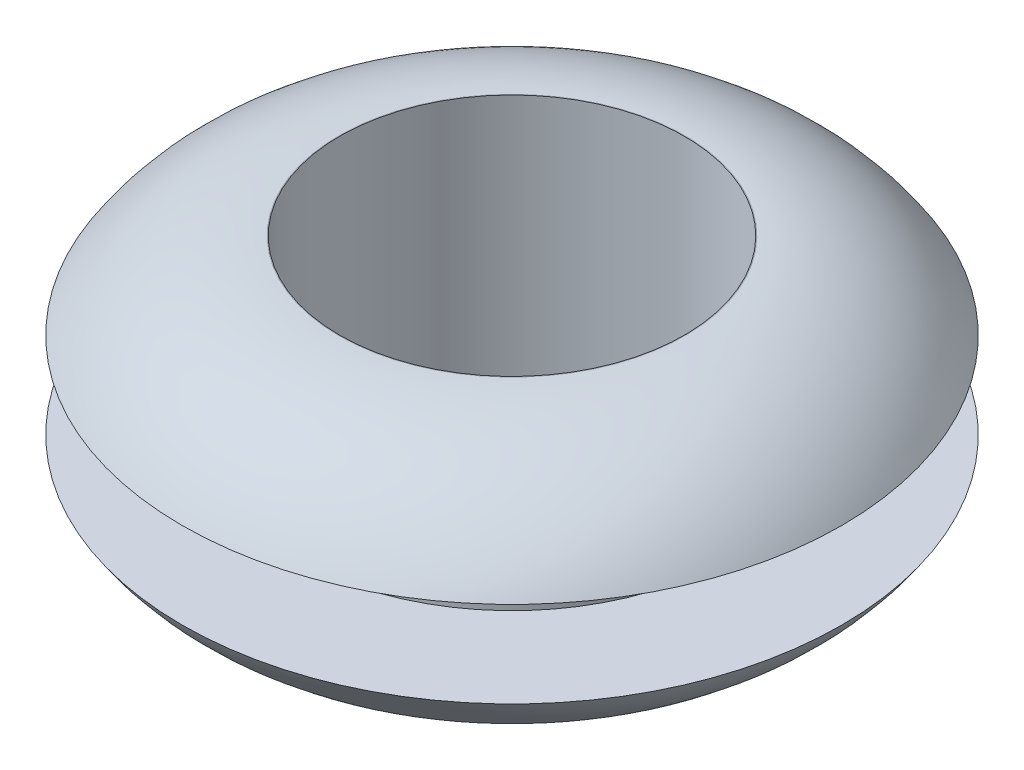
ISO-10303-21;
HEADER;
FILE_DESCRIPTION(('STEP AP214'),'2;1');
FILE_NAME('part.step','',(''),(''),'','','');
FILE_SCHEMA(('AUTOMOTIVE_DESIGN { 1 0 10303 214 1 1 1 1 }'));
ENDSEC;
DATA;
#1=APPLICATION_CONTEXT('core data for automotive mechanical design processes');
#2=APPLICATION_PROTOCOL_DEFINITION('international standard','automotive_design',2000,#1);
#3=PRODUCT_CONTEXT('',#1,'mechanical');
#4=PRODUCT('Part','Part','',(#3));
#5=PRODUCT_RELATED_PRODUCT_CATEGORY('part','',(#4));
#6=PRODUCT_DEFINITION_FORMATION('','',#4);
#7=PRODUCT_DEFINITION_CONTEXT('part definition',#1,'design');
#8=PRODUCT_DEFINITION('design','',#6,#7);
#9=PRODUCT_DEFINITION_SHAPE('','',#8);
#10=(LENGTH_UNIT() NAMED_UNIT(*) SI_UNIT(.MILLI.,.METRE.));
#11=(NAMED_UNIT(*) PLANE_ANGLE_UNIT() SI_UNIT($,.RADIAN.));
#12=(NAMED_UNIT(*) SI_UNIT($,.STERADIAN.) SOLID_ANGLE_UNIT());
#13=UNCERTAINTY_MEASURE_WITH_UNIT(LENGTH_MEASURE(1.E-05),#10,'distance_accuracy_value','');
#14=(GEOMETRIC_REPRESENTATION_CONTEXT(3) GLOBAL_UNCERTAINTY_ASSIGNED_CONTEXT((#13)) GLOBAL_UNIT_ASSIGNED_CONTEXT((#10,
#11,#12)) REPRESENTATION_CONTEXT('',''));
#15=CARTESIAN_POINT('',(0.,0.,0.));
#16=DIRECTION('',(0.,0.,1.));
#17=DIRECTION('',(1.,0.,0.));
#18=AXIS2_PLACEMENT_3D('',#15,#16,#17);
#19=CARTESIAN_POINT('',(0.,6.,0.));
#20=DIRECTION('',(0.,1.,0.));
#21=DIRECTION('',(0.,0.,1.));
#22=AXIS2_PLACEMENT_3D('',#19,#20,#21);
#23=PLANE('',#22);
#24=CARTESIAN_POINT('',(0.,6.,0.));
#25=DIRECTION('',(0.,1.,0.));
#26=DIRECTION('',(0.,0.,1.));
#27=AXIS2_PLACEMENT_3D('',#24,#25,#26);
#28=CIRCLE('',#27,4.01681957508301);
#29=CARTESIAN_POINT('',(0.,6.,4.01681957508301));
#30=VERTEX_POINT('',#29);
#31=EDGE_CURVE('E10',#30,#30,#28,.T.);
#32=ORIENTED_EDGE('',*,*,#31,.T.);
#33=EDGE_LOOP('',(#32));
#34=FACE_BOUND('',#33,.T.);
#35=CARTESIAN_POINT('',(0.,6.,0.));
#36=DIRECTION('',(0.,1.,0.));
#37=DIRECTION('',(0.,0.,1.));
#38=AXIS2_PLACEMENT_3D('',#35,#36,#37);
#39=CIRCLE('',#38,4.);
#40=CARTESIAN_POINT('',(0.,6.,4.));
#41=VERTEX_POINT('',#40);
#42=EDGE_CURVE('E41',#41,#41,#39,.T.);
#43=ORIENTED_EDGE('',*,*,#42,.F.);
#44=EDGE_LOOP('',(#43));
#45=FACE_BOUND('',#44,.T.);
#46=ADVANCED_FACE('F30',(#34,#45),#23,.T.);
#47=CARTESIAN_POINT('',(0.,0.,0.));
#48=DIRECTION('',(0.,1.,0.));
#49=DIRECTION('',(0.,0.,1.));
#50=AXIS2_PLACEMENT_3D('',#47,#48,#49);
#51=PLANE('',#50);
#52=CARTESIAN_POINT('',(0.,0.,0.));
#53=DIRECTION('',(0.,1.,0.));
#54=DIRECTION('',(0.,0.,1.));
#55=AXIS2_PLACEMENT_3D('',#52,#53,#54);
#56=CIRCLE('',#55,4.01681957508301);
#57=CARTESIAN_POINT('',(0.,0.,4.01681957508301));
#58=VERTEX_POINT('',#57);
#59=EDGE_CURVE('E37',#58,#58,#56,.F.);
#60=ORIENTED_EDGE('',*,*,#59,.T.);
#61=EDGE_LOOP('',(#60));
#62=FACE_BOUND('',#61,.T.);
#63=CARTESIAN_POINT('',(0.,0.,0.));
#64=DIRECTION('',(0.,1.,0.));
#65=DIRECTION('',(0.,0.,1.));
#66=AXIS2_PLACEMENT_3D('',#63,#64,#65);
#67=CIRCLE('',#66,4.);
#68=CARTESIAN_POINT('',(0.,0.,4.));
#69=VERTEX_POINT('',#68);
#70=EDGE_CURVE('E45',#69,#69,#67,.T.);
#71=ORIENTED_EDGE('',*,*,#70,.T.);
#72=EDGE_LOOP('',(#71));
#73=FACE_BOUND('',#72,.T.);
#74=ADVANCED_FACE('F85',(#62,#73),#51,.F.);
#75=CARTESIAN_POINT('',(0.,6.,0.));
#76=DIRECTION('',(0.,-1.,0.));
#77=DIRECTION('',(0.,0.,-1.));
#78=AXIS2_PLACEMENT_3D('',#75,#76,#77);
#79=CYLINDRICAL_SURFACE('',#78,4.);
#80=ORIENTED_EDGE('',*,*,#42,.T.);
#81=EDGE_LOOP('',(#80));
#82=FACE_BOUND('',#81,.T.);
#83=ORIENTED_EDGE('',*,*,#70,.F.);
#84=EDGE_LOOP('',(#83));
#85=FACE_BOUND('',#84,.T.);
#86=ADVANCED_FACE('F70',(#82,#85),#79,.F.);
#87=CARTESIAN_POINT('',(0.,2.,0.));
#88=DIRECTION('',(0.,1.,0.));
#89=DIRECTION('',(0.,0.,1.));
#90=AXIS2_PLACEMENT_3D('',#87,#88,#89);
#91=PLANE('',#90);
#92=CARTESIAN_POINT('',(0.,2.,0.));
#93=DIRECTION('',(0.,1.,0.));
#94=DIRECTION('',(0.,0.,1.));
#95=AXIS2_PLACEMENT_3D('',#92,#93,#94);
#96=CIRCLE('',#95,5.);
#97=CARTESIAN_POINT('',(0.,2.,5.));
#98=VERTEX_POINT('',#97);
#99=EDGE_CURVE('E54',#98,#98,#96,.T.);
#100=ORIENTED_EDGE('',*,*,#99,.F.);
#101=EDGE_LOOP('',(#100));
#102=FACE_BOUND('',#101,.T.);
#103=CARTESIAN_POINT('',(0.,2.,0.));
#104=DIRECTION('',(0.,1.,0.));
#105=DIRECTION('',(0.,0.,1.));
#106=AXIS2_PLACEMENT_3D('',#103,#104,#105);
#107=CIRCLE('',#106,7.65);
#108=CARTESIAN_POINT('',(0.,2.,7.65));
#109=VERTEX_POINT('',#108);
#110=EDGE_CURVE('E49',#109,#109,#107,.T.);
#111=ORIENTED_EDGE('',*,*,#110,.T.);
#112=EDGE_LOOP('',(#111));
#113=FACE_BOUND('',#112,.T.);
#114=ADVANCED_FACE('F66',(#102,#113),#91,.T.);
#115=CARTESIAN_POINT('',(0.,4.,0.));
#116=DIRECTION('',(0.,1.,0.));
#117=DIRECTION('',(0.,0.,1.));
#118=AXIS2_PLACEMENT_3D('',#115,#116,#117);
#119=PLANE('',#118);
#120=CARTESIAN_POINT('',(0.,4.,0.));
#121=DIRECTION('',(0.,1.,0.));
#122=DIRECTION('',(0.,0.,1.));
#123=AXIS2_PLACEMENT_3D('',#120,#121,#122);
#124=CIRCLE('',#123,5.);
#125=CARTESIAN_POINT('',(0.,4.,5.));
#126=VERTEX_POINT('',#125);
#127=EDGE_CURVE('E57',#126,#126,#124,.T.);
#128=ORIENTED_EDGE('',*,*,#127,.T.);
#129=EDGE_LOOP('',(#128));
#130=FACE_BOUND('',#129,.T.);
#131=CARTESIAN_POINT('',(0.,4.,0.));
#132=DIRECTION('',(0.,1.,0.));
#133=DIRECTION('',(0.,0.,1.));
#134=AXIS2_PLACEMENT_3D('',#131,#132,#133);
#135=CIRCLE('',#134,7.65);
#136=CARTESIAN_POINT('',(0.,4.,7.65));
#137=VERTEX_POINT('',#136);
#138=EDGE_CURVE('E51',#137,#137,#135,.T.);
#139=ORIENTED_EDGE('',*,*,#138,.F.);
#140=EDGE_LOOP('',(#139));
#141=FACE_BOUND('',#140,.T.);
#142=ADVANCED_FACE('F69',(#130,#141),#119,.F.);
#143=CARTESIAN_POINT('',(0.,2.,0.));
#144=DIRECTION('',(0.,1.,0.));
#145=DIRECTION('',(0.,0.,1.));
#146=AXIS2_PLACEMENT_3D('',#143,#144,#145);
#147=CYLINDRICAL_SURFACE('',#146,5.);
#148=ORIENTED_EDGE('',*,*,#99,.T.);
#149=EDGE_LOOP('',(#148));
#150=FACE_BOUND('',#149,.T.);
#151=ORIENTED_EDGE('',*,*,#127,.F.);
#152=EDGE_LOOP('',(#151));
#153=FACE_BOUND('',#152,.T.);
#154=ADVANCED_FACE('F63',(#150,#153),#147,.T.);
#155=CARTESIAN_POINT('',(0.,4.3,0.));
#156=DIRECTION('',(0.,-1.,0.));
#157=DIRECTION('',(0.,0.,-1.));
#158=AXIS2_PLACEMENT_3D('',#155,#156,#157);
#159=DEGENERATE_TOROIDAL_SURFACE('',#158,4.01681957508301,4.3,.T.);
#160=ORIENTED_EDGE('',*,*,#59,.F.);
#161=EDGE_LOOP('',(#160));
#162=FACE_BOUND('',#161,.T.);
#163=ORIENTED_EDGE('',*,*,#110,.F.);
#164=EDGE_LOOP('',(#163));
#165=FACE_BOUND('',#164,.T.);
#166=ADVANCED_FACE('F74',(#162,#165),#159,.T.);
#167=CARTESIAN_POINT('',(0.,1.7,0.));
#168=DIRECTION('',(0.,-1.,0.));
#169=DIRECTION('',(0.,0.,-1.));
#170=AXIS2_PLACEMENT_3D('',#167,#168,#169);
#171=DEGENERATE_TOROIDAL_SURFACE('',#170,4.01681957508301,4.3,.T.);
#172=ORIENTED_EDGE('',*,*,#138,.T.);
#173=EDGE_LOOP('',(#172));
#174=FACE_BOUND('',#173,.T.);
#175=ORIENTED_EDGE('',*,*,#31,.F.);
#176=EDGE_LOOP('',(#175));
#177=FACE_BOUND('',#176,.T.);
#178=ADVANCED_FACE('F32',(#174,#177),#171,.T.);
#179=CLOSED_SHELL('',(#46,#74,#86,#114,#142,#154,#166,#178));
#180=MANIFOLD_SOLID_BREP('B2',#179);
#181=ADVANCED_BREP_SHAPE_REPRESENTATION('',(#18,#180),#14);
#182=SHAPE_DEFINITION_REPRESENTATION(#9,#181);
ENDSEC;
END-ISO-10303-21;
